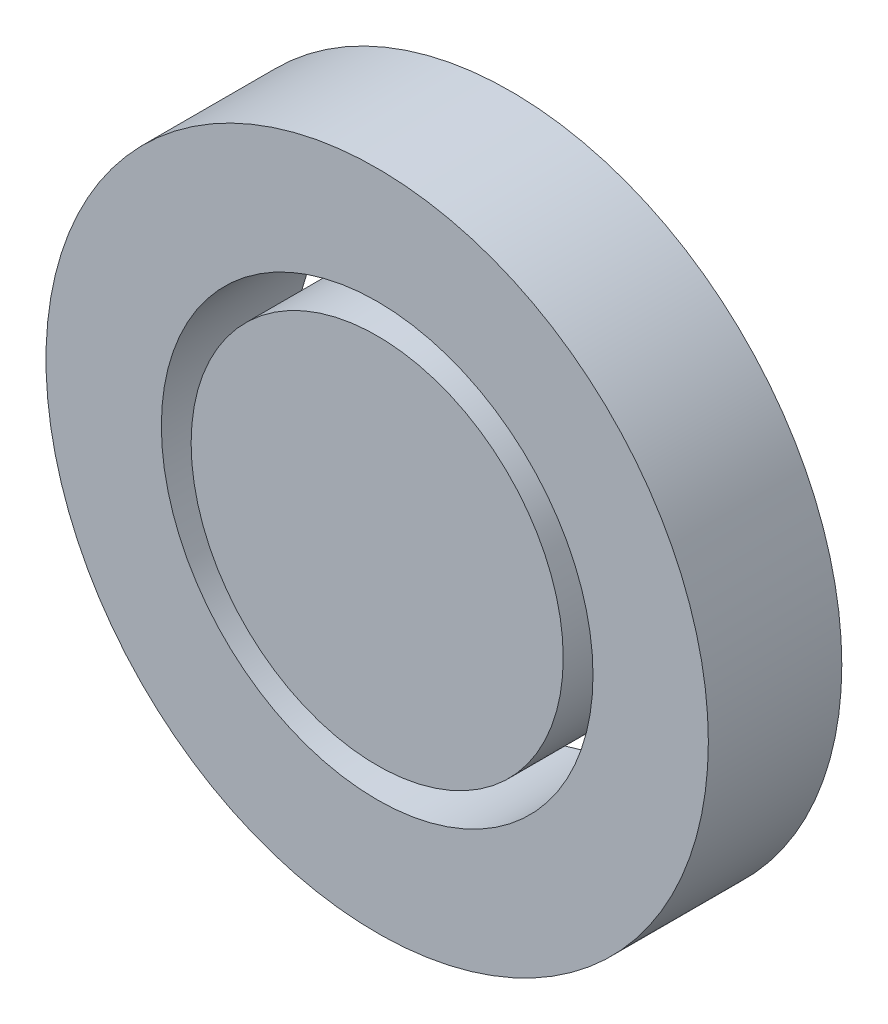
ISO-10303-21;
HEADER;
FILE_DESCRIPTION(('STEP AP214'),'2;1');
FILE_NAME('part.step','',(''),(''),'','','');
FILE_SCHEMA(('AUTOMOTIVE_DESIGN { 1 0 10303 214 1 1 1 1 }'));
ENDSEC;
DATA;
#1=APPLICATION_CONTEXT('core data for automotive mechanical design processes');
#2=APPLICATION_PROTOCOL_DEFINITION('international standard','automotive_design',2000,#1);
#3=PRODUCT_CONTEXT('',#1,'mechanical');
#4=PRODUCT('Part','Part','',(#3));
#5=PRODUCT_RELATED_PRODUCT_CATEGORY('part','',(#4));
#6=PRODUCT_DEFINITION_FORMATION('','',#4);
#7=PRODUCT_DEFINITION_CONTEXT('part definition',#1,'design');
#8=PRODUCT_DEFINITION('design','',#6,#7);
#9=PRODUCT_DEFINITION_SHAPE('','',#8);
#10=(LENGTH_UNIT() NAMED_UNIT(*) SI_UNIT(.MILLI.,.METRE.));
#11=(NAMED_UNIT(*) PLANE_ANGLE_UNIT() SI_UNIT($,.RADIAN.));
#12=(NAMED_UNIT(*) SI_UNIT($,.STERADIAN.) SOLID_ANGLE_UNIT());
#13=UNCERTAINTY_MEASURE_WITH_UNIT(LENGTH_MEASURE(1.E-05),#10,'distance_accuracy_value','');
#14=(GEOMETRIC_REPRESENTATION_CONTEXT(3) GLOBAL_UNCERTAINTY_ASSIGNED_CONTEXT((#13)) GLOBAL_UNIT_ASSIGNED_CONTEXT((#10,
#11,#12)) REPRESENTATION_CONTEXT('',''));
#15=CARTESIAN_POINT('',(0.,0.,0.));
#16=DIRECTION('',(0.,0.,1.));
#17=DIRECTION('',(1.,0.,0.));
#18=AXIS2_PLACEMENT_3D('',#15,#16,#17);
#19=CARTESIAN_POINT('',(0.,0.,53.8));
#20=DIRECTION('',(0.,0.,1.));
#21=DIRECTION('',(1.,0.,0.));
#22=AXIS2_PLACEMENT_3D('',#19,#20,#21);
#23=PLANE('',#22);
#24=CARTESIAN_POINT('',(0.,0.,53.8));
#25=DIRECTION('',(0.,0.,1.));
#26=DIRECTION('',(1.,0.,0.));
#27=AXIS2_PLACEMENT_3D('',#24,#25,#26);
#28=CIRCLE('',#27,133.5);
#29=CARTESIAN_POINT('',(133.5,0.,53.8));
#30=VERTEX_POINT('',#29);
#31=EDGE_CURVE('E12',#30,#30,#28,.T.);
#32=ORIENTED_EDGE('',*,*,#31,.T.);
#33=EDGE_LOOP('',(#32));
#34=FACE_BOUND('',#33,.T.);
#35=CARTESIAN_POINT('',(0.,0.,53.8));
#36=DIRECTION('',(0.,0.,1.));
#37=DIRECTION('',(1.,0.,0.));
#38=AXIS2_PLACEMENT_3D('',#35,#36,#37);
#39=CIRCLE('',#38,87.);
#40=CARTESIAN_POINT('',(87.,0.,53.8));
#41=VERTEX_POINT('',#40);
#42=EDGE_CURVE('E57',#41,#41,#39,.T.);
#43=ORIENTED_EDGE('',*,*,#42,.F.);
#44=EDGE_LOOP('',(#43));
#45=FACE_BOUND('',#44,.T.);
#46=ADVANCED_FACE('F46',(#34,#45),#23,.T.);
#47=CARTESIAN_POINT('',(0.,0.,0.));
#48=DIRECTION('',(0.,0.,1.));
#49=DIRECTION('',(1.,0.,0.));
#50=AXIS2_PLACEMENT_3D('',#47,#48,#49);
#51=PLANE('',#50);
#52=CARTESIAN_POINT('',(0.,0.,0.));
#53=DIRECTION('',(0.,0.,1.));
#54=DIRECTION('',(1.,0.,0.));
#55=AXIS2_PLACEMENT_3D('',#52,#53,#54);
#56=CIRCLE('',#55,133.5);
#57=CARTESIAN_POINT('',(133.5,0.,0.));
#58=VERTEX_POINT('',#57);
#59=EDGE_CURVE('E50',#58,#58,#56,.T.);
#60=ORIENTED_EDGE('',*,*,#59,.F.);
#61=EDGE_LOOP('',(#60));
#62=FACE_BOUND('',#61,.T.);
#63=CARTESIAN_POINT('',(0.,0.,0.));
#64=DIRECTION('',(0.,0.,1.));
#65=DIRECTION('',(1.,0.,0.));
#66=AXIS2_PLACEMENT_3D('',#63,#64,#65);
#67=CIRCLE('',#66,87.);
#68=CARTESIAN_POINT('',(87.,0.,0.));
#69=VERTEX_POINT('',#68);
#70=EDGE_CURVE('E59',#69,#69,#67,.T.);
#71=ORIENTED_EDGE('',*,*,#70,.T.);
#72=EDGE_LOOP('',(#71));
#73=FACE_BOUND('',#72,.T.);
#74=ADVANCED_FACE('F69',(#62,#73),#51,.F.);
#75=CARTESIAN_POINT('',(0.,0.,53.8));
#76=DIRECTION('',(0.,0.,-1.));
#77=DIRECTION('',(-1.,0.,0.));
#78=AXIS2_PLACEMENT_3D('',#75,#76,#77);
#79=CYLINDRICAL_SURFACE('',#78,133.5);
#80=ORIENTED_EDGE('',*,*,#31,.F.);
#81=EDGE_LOOP('',(#80));
#82=FACE_BOUND('',#81,.T.);
#83=ORIENTED_EDGE('',*,*,#59,.T.);
#84=EDGE_LOOP('',(#83));
#85=FACE_BOUND('',#84,.T.);
#86=ADVANCED_FACE('F48',(#82,#85),#79,.T.);
#87=CARTESIAN_POINT('',(0.,0.,53.8));
#88=DIRECTION('',(0.,0.,-1.));
#89=DIRECTION('',(-1.,0.,0.));
#90=AXIS2_PLACEMENT_3D('',#87,#88,#89);
#91=CYLINDRICAL_SURFACE('',#90,87.);
#92=ORIENTED_EDGE('',*,*,#42,.T.);
#93=EDGE_LOOP('',(#92));
#94=FACE_BOUND('',#93,.T.);
#95=ORIENTED_EDGE('',*,*,#70,.F.);
#96=EDGE_LOOP('',(#95));
#97=FACE_BOUND('',#96,.T.);
#98=ADVANCED_FACE('F65',(#94,#97),#91,.F.);
#99=CLOSED_SHELL('',(#46,#74,#86,#98));
#100=MANIFOLD_SOLID_BREP('B2',#99);
#101=CARTESIAN_POINT('',(0.,0.,53.8));
#102=DIRECTION('',(0.,0.,-1.));
#103=DIRECTION('',(-1.,0.,0.));
#104=AXIS2_PLACEMENT_3D('',#101,#102,#103);
#105=CYLINDRICAL_SURFACE('',#104,75.);
#106=CARTESIAN_POINT('',(0.,0.,53.8));
#107=DIRECTION('',(0.,0.,1.));
#108=DIRECTION('',(1.,0.,0.));
#109=AXIS2_PLACEMENT_3D('',#106,#107,#108);
#110=CIRCLE('',#109,75.);
#111=CARTESIAN_POINT('',(75.,0.,53.8));
#112=VERTEX_POINT('',#111);
#113=EDGE_CURVE('E45',#112,#112,#110,.T.);
#114=ORIENTED_EDGE('',*,*,#113,.F.);
#115=EDGE_LOOP('',(#114));
#116=FACE_BOUND('',#115,.T.);
#117=CARTESIAN_POINT('',(0.,0.,0.));
#118=DIRECTION('',(0.,0.,1.));
#119=DIRECTION('',(1.,0.,0.));
#120=AXIS2_PLACEMENT_3D('',#117,#118,#119);
#121=CIRCLE('',#120,75.);
#122=CARTESIAN_POINT('',(75.,0.,0.));
#123=VERTEX_POINT('',#122);
#124=EDGE_CURVE('E110',#123,#123,#121,.T.);
#125=ORIENTED_EDGE('',*,*,#124,.T.);
#126=EDGE_LOOP('',(#125));
#127=FACE_BOUND('',#126,.T.);
#128=ADVANCED_FACE('F107',(#116,#127),#105,.T.);
#129=CARTESIAN_POINT('',(0.,0.,53.8));
#130=DIRECTION('',(0.,0.,1.));
#131=DIRECTION('',(1.,0.,0.));
#132=AXIS2_PLACEMENT_3D('',#129,#130,#131);
#133=PLANE('',#132);
#134=ORIENTED_EDGE('',*,*,#113,.T.);
#135=EDGE_LOOP('',(#134));
#136=FACE_BOUND('',#135,.T.);
#137=ADVANCED_FACE('F122',(#136),#133,.T.);
#138=CARTESIAN_POINT('',(0.,0.,0.));
#139=DIRECTION('',(0.,0.,1.));
#140=DIRECTION('',(1.,0.,0.));
#141=AXIS2_PLACEMENT_3D('',#138,#139,#140);
#142=PLANE('',#141);
#143=ORIENTED_EDGE('',*,*,#124,.F.);
#144=EDGE_LOOP('',(#143));
#145=FACE_BOUND('',#144,.T.);
#146=ADVANCED_FACE('F120',(#145),#142,.F.);
#147=CLOSED_SHELL('',(#128,#137,#146));
#148=MANIFOLD_SOLID_BREP('B7',#147);
#149=ADVANCED_BREP_SHAPE_REPRESENTATION('',(#18,#100,#148),#14);
#150=SHAPE_DEFINITION_REPRESENTATION(#9,#149);
ENDSEC;
END-ISO-10303-21;
